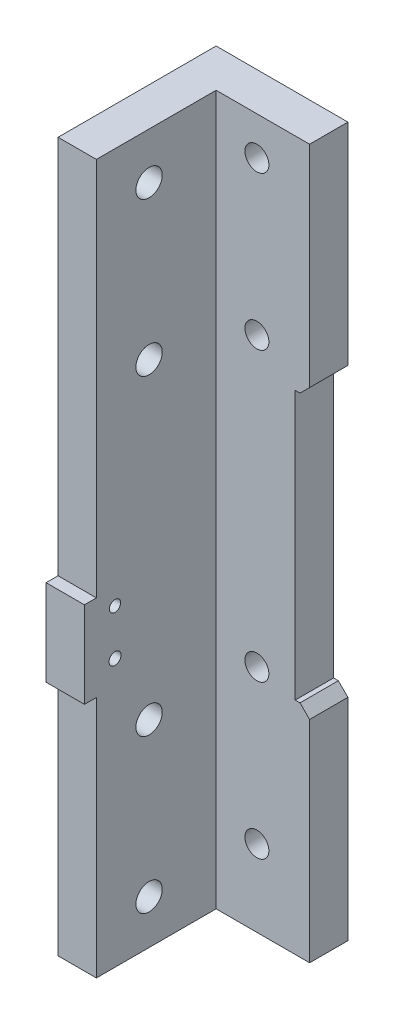
ISO-10303-21;
HEADER;
FILE_DESCRIPTION(('STEP AP214'),'2;1');
FILE_NAME('part.step','',(''),(''),'','','');
FILE_SCHEMA(('AUTOMOTIVE_DESIGN { 1 0 10303 214 1 1 1 1 }'));
ENDSEC;
DATA;
#1=APPLICATION_CONTEXT('core data for automotive mechanical design processes');
#2=APPLICATION_PROTOCOL_DEFINITION('international standard','automotive_design',2000,#1);
#3=PRODUCT_CONTEXT('',#1,'mechanical');
#4=PRODUCT('Part','Part','',(#3));
#5=PRODUCT_RELATED_PRODUCT_CATEGORY('part','',(#4));
#6=PRODUCT_DEFINITION_FORMATION('','',#4);
#7=PRODUCT_DEFINITION_CONTEXT('part definition',#1,'design');
#8=PRODUCT_DEFINITION('design','',#6,#7);
#9=PRODUCT_DEFINITION_SHAPE('','',#8);
#10=(LENGTH_UNIT() NAMED_UNIT(*) SI_UNIT(.MILLI.,.METRE.));
#11=(NAMED_UNIT(*) PLANE_ANGLE_UNIT() SI_UNIT($,.RADIAN.));
#12=(NAMED_UNIT(*) SI_UNIT($,.STERADIAN.) SOLID_ANGLE_UNIT());
#13=UNCERTAINTY_MEASURE_WITH_UNIT(LENGTH_MEASURE(1.E-05),#10,'distance_accuracy_value','');
#14=(GEOMETRIC_REPRESENTATION_CONTEXT(3) GLOBAL_UNCERTAINTY_ASSIGNED_CONTEXT((#13)) GLOBAL_UNIT_ASSIGNED_CONTEXT((#10,
#11,#12)) REPRESENTATION_CONTEXT('',''));
#15=CARTESIAN_POINT('',(0.,0.,0.));
#16=DIRECTION('',(0.,0.,1.));
#17=DIRECTION('',(1.,0.,0.));
#18=AXIS2_PLACEMENT_3D('',#15,#16,#17);
#19=CARTESIAN_POINT('',(0.,0.,33.));
#20=DIRECTION('',(0.,0.,1.));
#21=DIRECTION('',(1.,0.,0.));
#22=AXIS2_PLACEMENT_3D('',#19,#20,#21);
#23=PLANE('',#22);
#24=DIRECTION('',(-1.,0.,0.));
#25=VECTOR('',#24,1.);
#26=CARTESIAN_POINT('',(0.,68.7222488833628,33.));
#27=LINE('',#26,#25);
#28=CARTESIAN_POINT('',(-16.51,68.7222488833628,33.));
#29=VERTEX_POINT('',#28);
#30=CARTESIAN_POINT('',(-24.51,68.7222488833628,33.));
#31=VERTEX_POINT('',#30);
#32=EDGE_CURVE('E11',#29,#31,#27,.T.);
#33=ORIENTED_EDGE('',*,*,#32,.F.);
#34=DIRECTION('',(0.,1.,0.));
#35=VECTOR('',#34,1.);
#36=CARTESIAN_POINT('',(-16.51,148.,33.));
#37=LINE('',#36,#35);
#38=CARTESIAN_POINT('',(-16.51,148.,33.));
#39=VERTEX_POINT('',#38);
#40=EDGE_CURVE('E419',#29,#39,#37,.T.);
#41=ORIENTED_EDGE('',*,*,#40,.T.);
#42=DIRECTION('',(-1.,0.,0.));
#43=VECTOR('',#42,1.);
#44=CARTESIAN_POINT('',(-24.51,148.,33.));
#45=LINE('',#44,#43);
#46=CARTESIAN_POINT('',(-24.51,148.,33.));
#47=VERTEX_POINT('',#46);
#48=EDGE_CURVE('E385',#39,#47,#45,.T.);
#49=ORIENTED_EDGE('',*,*,#48,.T.);
#50=DIRECTION('',(0.,-1.,0.));
#51=VECTOR('',#50,1.);
#52=CARTESIAN_POINT('',(-24.51,148.,33.));
#53=LINE('',#52,#51);
#54=EDGE_CURVE('E415',#47,#31,#53,.T.);
#55=ORIENTED_EDGE('',*,*,#54,.T.);
#56=EDGE_LOOP('',(#33,#41,#49,#55));
#57=FACE_BOUND('',#56,.T.);
#58=ADVANCED_FACE('F39',(#57),#23,.T.);
#59=CARTESIAN_POINT('',(0.,0.,8.));
#60=DIRECTION('',(-1.,0.,0.));
#61=DIRECTION('',(0.,0.,1.));
#62=AXIS2_PLACEMENT_3D('',#59,#60,#61);
#63=PLANE('',#62);
#64=DIRECTION('',(0.,1.,0.));
#65=VECTOR('',#64,1.);
#66=CARTESIAN_POINT('',(0.,0.,8.));
#67=LINE('',#66,#65);
#68=CARTESIAN_POINT('',(0.,46.,8.));
#69=VERTEX_POINT('',#68);
#70=CARTESIAN_POINT('',(0.,102.,8.));
#71=VERTEX_POINT('',#70);
#72=EDGE_CURVE('E352',#69,#71,#67,.T.);
#73=ORIENTED_EDGE('',*,*,#72,.F.);
#74=DIRECTION('',(0.,0.,-1.));
#75=VECTOR('',#74,1.);
#76=CARTESIAN_POINT('',(0.,46.,54.0977222864644));
#77=LINE('',#76,#75);
#78=CARTESIAN_POINT('',(0.,46.,0.));
#79=VERTEX_POINT('',#78);
#80=EDGE_CURVE('E196',#69,#79,#77,.T.);
#81=ORIENTED_EDGE('',*,*,#80,.T.);
#82=DIRECTION('',(0.,1.,0.));
#83=VECTOR('',#82,1.);
#84=CARTESIAN_POINT('',(0.,0.,0.));
#85=LINE('',#84,#83);
#86=CARTESIAN_POINT('',(0.,102.,0.));
#87=VERTEX_POINT('',#86);
#88=EDGE_CURVE('E351',#79,#87,#85,.T.);
#89=ORIENTED_EDGE('',*,*,#88,.T.);
#90=DIRECTION('',(0.,0.,-1.));
#91=VECTOR('',#90,1.);
#92=CARTESIAN_POINT('',(0.,102.,54.0977222864644));
#93=LINE('',#92,#91);
#94=EDGE_CURVE('E212',#71,#87,#93,.T.);
#95=ORIENTED_EDGE('',*,*,#94,.F.);
#96=EDGE_LOOP('',(#73,#81,#89,#95));
#97=FACE_BOUND('',#96,.T.);
#98=ADVANCED_FACE('F283',(#97),#63,.F.);
#99=CARTESIAN_POINT('',(0.,148.,8.));
#100=DIRECTION('',(0.,-1.,0.));
#101=DIRECTION('',(0.,0.,-1.));
#102=AXIS2_PLACEMENT_3D('',#99,#100,#101);
#103=PLANE('',#102);
#104=DIRECTION('',(-1.,0.,0.));
#105=VECTOR('',#104,1.);
#106=CARTESIAN_POINT('',(0.,148.,0.));
#107=LINE('',#106,#105);
#108=CARTESIAN_POINT('',(3.,148.,0.));
#109=VERTEX_POINT('',#108);
#110=CARTESIAN_POINT('',(-24.51,148.,0.));
#111=VERTEX_POINT('',#110);
#112=EDGE_CURVE('E478',#109,#111,#107,.T.);
#113=ORIENTED_EDGE('',*,*,#112,.T.);
#114=DIRECTION('',(0.,0.,-1.));
#115=VECTOR('',#114,1.);
#116=CARTESIAN_POINT('',(-24.51,148.,8.));
#117=LINE('',#116,#115);
#118=EDGE_CURVE('E373',#47,#111,#117,.T.);
#119=ORIENTED_EDGE('',*,*,#118,.F.);
#120=ORIENTED_EDGE('',*,*,#48,.F.);
#121=DIRECTION('',(0.,0.,-1.));
#122=VECTOR('',#121,1.);
#123=CARTESIAN_POINT('',(-16.51,148.,33.));
#124=LINE('',#123,#122);
#125=CARTESIAN_POINT('',(-16.51,148.,8.));
#126=VERTEX_POINT('',#125);
#127=EDGE_CURVE('E381',#39,#126,#124,.T.);
#128=ORIENTED_EDGE('',*,*,#127,.T.);
#129=DIRECTION('',(-1.,0.,0.));
#130=VECTOR('',#129,1.);
#131=CARTESIAN_POINT('',(0.,148.,8.));
#132=LINE('',#131,#130);
#133=CARTESIAN_POINT('',(3.,148.,8.));
#134=VERTEX_POINT('',#133);
#135=EDGE_CURVE('E354',#134,#126,#132,.T.);
#136=ORIENTED_EDGE('',*,*,#135,.F.);
#137=DIRECTION('',(0.,0.,-1.));
#138=VECTOR('',#137,1.);
#139=CARTESIAN_POINT('',(3.,148.,54.0977222864644));
#140=LINE('',#139,#138);
#141=EDGE_CURVE('E207',#134,#109,#140,.T.);
#142=ORIENTED_EDGE('',*,*,#141,.T.);
#143=EDGE_LOOP('',(#113,#119,#120,#128,#136,#142));
#144=FACE_BOUND('',#143,.T.);
#145=ADVANCED_FACE('F266',(#144),#103,.F.);
#146=CARTESIAN_POINT('',(-24.51,0.,8.));
#147=DIRECTION('',(1.,0.,0.));
#148=DIRECTION('',(0.,0.,-1.));
#149=AXIS2_PLACEMENT_3D('',#146,#147,#148);
#150=PLANE('',#149);
#151=CARTESIAN_POINT('',(-24.51,55.8222488833634,29.1120529863074));
#152=DIRECTION('',(-1.,0.,0.));
#153=DIRECTION('',(0.,0.,1.));
#154=AXIS2_PLACEMENT_3D('',#151,#152,#153);
#155=CIRCLE('',#154,1.25);
#156=CARTESIAN_POINT('',(-24.51,55.8222488833634,30.3620529863074));
#157=VERTEX_POINT('',#156);
#158=EDGE_CURVE('E257',#157,#157,#155,.T.);
#159=ORIENTED_EDGE('',*,*,#158,.F.);
#160=EDGE_LOOP('',(#159));
#161=FACE_BOUND('',#160,.T.);
#162=CARTESIAN_POINT('',(-24.51,65.3222488833634,29.1120529863074));
#163=DIRECTION('',(-1.,0.,0.));
#164=DIRECTION('',(0.,0.,1.));
#165=AXIS2_PLACEMENT_3D('',#162,#163,#164);
#166=CIRCLE('',#165,1.175);
#167=CARTESIAN_POINT('',(-24.51,65.3222488833634,30.2870529863074));
#168=VERTEX_POINT('',#167);
#169=EDGE_CURVE('E251',#168,#168,#166,.T.);
#170=ORIENTED_EDGE('',*,*,#169,.F.);
#171=EDGE_LOOP('',(#170));
#172=FACE_BOUND('',#171,.T.);
#173=DIRECTION('',(0.,0.,-1.));
#174=VECTOR('',#173,1.);
#175=CARTESIAN_POINT('',(-24.51,68.7222488833628,29.5));
#176=LINE('',#175,#174);
#177=CARTESIAN_POINT('',(-24.51,68.7222488833628,35.5));
#178=VERTEX_POINT('',#177);
#179=EDGE_CURVE('E171',#178,#31,#176,.T.);
#180=ORIENTED_EDGE('',*,*,#179,.T.);
#181=ORIENTED_EDGE('',*,*,#54,.F.);
#182=ORIENTED_EDGE('',*,*,#118,.T.);
#183=DIRECTION('',(0.,-1.,0.));
#184=VECTOR('',#183,1.);
#185=CARTESIAN_POINT('',(-24.51,0.,0.));
#186=LINE('',#185,#184);
#187=CARTESIAN_POINT('',(-24.51,0.,0.));
#188=VERTEX_POINT('',#187);
#189=EDGE_CURVE('E359',#111,#188,#186,.T.);
#190=ORIENTED_EDGE('',*,*,#189,.T.);
#191=DIRECTION('',(0.,0.,-1.));
#192=VECTOR('',#191,1.);
#193=CARTESIAN_POINT('',(-24.51,0.,8.));
#194=LINE('',#193,#192);
#195=CARTESIAN_POINT('',(-24.51,0.,33.));
#196=VERTEX_POINT('',#195);
#197=EDGE_CURVE('E376',#196,#188,#194,.T.);
#198=ORIENTED_EDGE('',*,*,#197,.F.);
#199=CARTESIAN_POINT('',(-24.51,50.7222488833628,33.));
#200=VERTEX_POINT('',#199);
#201=EDGE_CURVE('E158',#200,#196,#53,.T.);
#202=ORIENTED_EDGE('',*,*,#201,.F.);
#203=DIRECTION('',(0.,0.,1.));
#204=VECTOR('',#203,1.);
#205=CARTESIAN_POINT('',(-24.51,50.7222488833628,29.5));
#206=LINE('',#205,#204);
#207=CARTESIAN_POINT('',(-24.51,50.7222488833628,35.5));
#208=VERTEX_POINT('',#207);
#209=EDGE_CURVE('E149',#200,#208,#206,.T.);
#210=ORIENTED_EDGE('',*,*,#209,.T.);
#211=DIRECTION('',(0.,1.,0.));
#212=VECTOR('',#211,1.);
#213=CARTESIAN_POINT('',(-24.51,50.7222488833628,35.5));
#214=LINE('',#213,#212);
#215=EDGE_CURVE('E155',#208,#178,#214,.T.);
#216=ORIENTED_EDGE('',*,*,#215,.T.);
#217=EDGE_LOOP('',(#180,#181,#182,#190,#198,#202,#210,#216));
#218=FACE_BOUND('',#217,.T.);
#219=CARTESIAN_POINT('',(-24.51,9.19999999999954,21.9999999999998));
#220=DIRECTION('',(-1.,0.,0.));
#221=DIRECTION('',(0.,0.,1.));
#222=AXIS2_PLACEMENT_3D('',#219,#220,#221);
#223=CIRCLE('',#222,2.75);
#224=CARTESIAN_POINT('',(-24.51,9.19999999999954,24.7499999999998));
#225=VERTEX_POINT('',#224);
#226=EDGE_CURVE('E216',#225,#225,#223,.T.);
#227=ORIENTED_EDGE('',*,*,#226,.F.);
#228=EDGE_LOOP('',(#227));
#229=FACE_BOUND('',#228,.T.);
#230=CARTESIAN_POINT('',(-24.51,41.1999999999995,21.9999999999998));
#231=DIRECTION('',(-1.,0.,0.));
#232=DIRECTION('',(0.,0.,1.));
#233=AXIS2_PLACEMENT_3D('',#230,#231,#232);
#234=CIRCLE('',#233,2.75);
#235=CARTESIAN_POINT('',(-24.51,41.1999999999995,24.7499999999998));
#236=VERTEX_POINT('',#235);
#237=EDGE_CURVE('E706',#236,#236,#234,.T.);
#238=ORIENTED_EDGE('',*,*,#237,.F.);
#239=EDGE_LOOP('',(#238));
#240=FACE_BOUND('',#239,.T.);
#241=CARTESIAN_POINT('',(-24.51,106.3,21.9999999999998));
#242=DIRECTION('',(-1.,0.,0.));
#243=DIRECTION('',(0.,0.,1.));
#244=AXIS2_PLACEMENT_3D('',#241,#242,#243);
#245=CIRCLE('',#244,2.75);
#246=CARTESIAN_POINT('',(-24.51,106.3,24.7499999999998));
#247=VERTEX_POINT('',#246);
#248=EDGE_CURVE('E700',#247,#247,#245,.T.);
#249=ORIENTED_EDGE('',*,*,#248,.F.);
#250=EDGE_LOOP('',(#249));
#251=FACE_BOUND('',#250,.T.);
#252=CARTESIAN_POINT('',(-24.51,138.3,21.9999999999998));
#253=DIRECTION('',(-1.,0.,0.));
#254=DIRECTION('',(0.,0.,1.));
#255=AXIS2_PLACEMENT_3D('',#252,#253,#254);
#256=CIRCLE('',#255,2.75);
#257=CARTESIAN_POINT('',(-24.51,138.3,24.7499999999998));
#258=VERTEX_POINT('',#257);
#259=EDGE_CURVE('E692',#258,#258,#256,.T.);
#260=ORIENTED_EDGE('',*,*,#259,.F.);
#261=EDGE_LOOP('',(#260));
#262=FACE_BOUND('',#261,.T.);
#263=ADVANCED_FACE('F152',(#161,#172,#218,#229,#240,#251,#262),#150,.F.);
#264=CARTESIAN_POINT('',(0.,0.,8.));
#265=DIRECTION('',(0.,1.,0.));
#266=DIRECTION('',(-1.,0.,0.));
#267=AXIS2_PLACEMENT_3D('',#264,#265,#266);
#268=PLANE('',#267);
#269=DIRECTION('',(1.,0.,0.));
#270=VECTOR('',#269,1.);
#271=CARTESIAN_POINT('',(0.,0.,0.));
#272=LINE('',#271,#270);
#273=CARTESIAN_POINT('',(3.,0.,0.));
#274=VERTEX_POINT('',#273);
#275=EDGE_CURVE('E355',#188,#274,#272,.T.);
#276=ORIENTED_EDGE('',*,*,#275,.T.);
#277=DIRECTION('',(0.,0.,-1.));
#278=VECTOR('',#277,1.);
#279=CARTESIAN_POINT('',(3.,0.,54.0977222864644));
#280=LINE('',#279,#278);
#281=CARTESIAN_POINT('',(3.,0.,8.));
#282=VERTEX_POINT('',#281);
#283=EDGE_CURVE('E193',#282,#274,#280,.T.);
#284=ORIENTED_EDGE('',*,*,#283,.F.);
#285=DIRECTION('',(1.,0.,0.));
#286=VECTOR('',#285,1.);
#287=CARTESIAN_POINT('',(0.,0.,8.));
#288=LINE('',#287,#286);
#289=CARTESIAN_POINT('',(-16.51,0.,8.));
#290=VERTEX_POINT('',#289);
#291=EDGE_CURVE('E356',#290,#282,#288,.T.);
#292=ORIENTED_EDGE('',*,*,#291,.F.);
#293=DIRECTION('',(0.,0.,-1.));
#294=VECTOR('',#293,1.);
#295=CARTESIAN_POINT('',(-16.51,0.,33.));
#296=LINE('',#295,#294);
#297=CARTESIAN_POINT('',(-16.51,0.,33.));
#298=VERTEX_POINT('',#297);
#299=EDGE_CURVE('E384',#298,#290,#296,.T.);
#300=ORIENTED_EDGE('',*,*,#299,.F.);
#301=DIRECTION('',(1.,0.,0.));
#302=VECTOR('',#301,1.);
#303=CARTESIAN_POINT('',(-24.51,0.,33.));
#304=LINE('',#303,#302);
#305=EDGE_CURVE('E417',#196,#298,#304,.T.);
#306=ORIENTED_EDGE('',*,*,#305,.F.);
#307=ORIENTED_EDGE('',*,*,#197,.T.);
#308=EDGE_LOOP('',(#276,#284,#292,#300,#306,#307));
#309=FACE_BOUND('',#308,.T.);
#310=ADVANCED_FACE('F265',(#309),#268,.F.);
#311=CARTESIAN_POINT('',(0.,0.,8.));
#312=DIRECTION('',(0.,0.,1.));
#313=DIRECTION('',(1.,0.,0.));
#314=AXIS2_PLACEMENT_3D('',#311,#312,#313);
#315=PLANE('',#314);
#316=CARTESIAN_POINT('',(-8.,140.,8.));
#317=DIRECTION('',(0.,0.,1.));
#318=DIRECTION('',(-1.,0.,0.));
#319=AXIS2_PLACEMENT_3D('',#316,#317,#318);
#320=CIRCLE('',#319,2.5);
#321=CARTESIAN_POINT('',(-10.5,140.,8.));
#322=VERTEX_POINT('',#321);
#323=EDGE_CURVE('E409',#322,#322,#320,.T.);
#324=ORIENTED_EDGE('',*,*,#323,.F.);
#325=EDGE_LOOP('',(#324));
#326=FACE_BOUND('',#325,.T.);
#327=CARTESIAN_POINT('',(-8.,108.,8.));
#328=DIRECTION('',(0.,0.,1.));
#329=DIRECTION('',(-1.,0.,0.));
#330=AXIS2_PLACEMENT_3D('',#327,#328,#329);
#331=CIRCLE('',#330,2.5);
#332=CARTESIAN_POINT('',(-10.5,108.,8.));
#333=VERTEX_POINT('',#332);
#334=EDGE_CURVE('E399',#333,#333,#331,.T.);
#335=ORIENTED_EDGE('',*,*,#334,.F.);
#336=EDGE_LOOP('',(#335));
#337=FACE_BOUND('',#336,.T.);
#338=CARTESIAN_POINT('',(-8.,48.,8.));
#339=DIRECTION('',(0.,0.,1.));
#340=DIRECTION('',(1.,0.,0.));
#341=AXIS2_PLACEMENT_3D('',#338,#339,#340);
#342=CIRCLE('',#341,2.5);
#343=CARTESIAN_POINT('',(-5.5,48.,8.));
#344=VERTEX_POINT('',#343);
#345=EDGE_CURVE('E396',#344,#344,#342,.T.);
#346=ORIENTED_EDGE('',*,*,#345,.F.);
#347=EDGE_LOOP('',(#346));
#348=FACE_BOUND('',#347,.T.);
#349=CARTESIAN_POINT('',(-8.,16.,8.));
#350=DIRECTION('',(0.,0.,1.));
#351=DIRECTION('',(1.,0.,0.));
#352=AXIS2_PLACEMENT_3D('',#349,#350,#351);
#353=CIRCLE('',#352,2.5);
#354=CARTESIAN_POINT('',(-5.5,16.,8.));
#355=VERTEX_POINT('',#354);
#356=EDGE_CURVE('E393',#355,#355,#353,.T.);
#357=ORIENTED_EDGE('',*,*,#356,.F.);
#358=EDGE_LOOP('',(#357));
#359=FACE_BOUND('',#358,.T.);
#360=DIRECTION('',(0.,-1.,0.));
#361=VECTOR('',#360,1.);
#362=CARTESIAN_POINT('',(3.,0.,8.));
#363=LINE('',#362,#361);
#364=CARTESIAN_POINT('',(3.,44.,8.));
#365=VERTEX_POINT('',#364);
#366=EDGE_CURVE('E191',#365,#282,#363,.T.);
#367=ORIENTED_EDGE('',*,*,#366,.F.);
#368=DIRECTION('',(0.707106781186545,-0.70710678118655,0.));
#369=VECTOR('',#368,1.);
#370=CARTESIAN_POINT('',(23.5,23.4999999999998,8.));
#371=LINE('',#370,#369);
#372=CARTESIAN_POINT('',(0.999999999999994,46.,8.));
#373=VERTEX_POINT('',#372);
#374=EDGE_CURVE('E237',#365,#373,#371,.F.);
#375=ORIENTED_EDGE('',*,*,#374,.T.);
#376=DIRECTION('',(1.,0.,0.));
#377=VECTOR('',#376,1.);
#378=CARTESIAN_POINT('',(0.,46.,8.));
#379=LINE('',#378,#377);
#380=EDGE_CURVE('E186',#69,#373,#379,.T.);
#381=ORIENTED_EDGE('',*,*,#380,.F.);
#382=ORIENTED_EDGE('',*,*,#72,.T.);
#383=DIRECTION('',(-1.,0.,0.));
#384=VECTOR('',#383,1.);
#385=CARTESIAN_POINT('',(0.,102.,8.));
#386=LINE('',#385,#384);
#387=CARTESIAN_POINT('',(0.999999999999998,102.,8.));
#388=VERTEX_POINT('',#387);
#389=EDGE_CURVE('E206',#388,#71,#386,.T.);
#390=ORIENTED_EDGE('',*,*,#389,.F.);
#391=DIRECTION('',(-0.70710678118655,-0.707106781186545,0.));
#392=VECTOR('',#391,1.);
#393=CARTESIAN_POINT('',(-50.5,50.5000000000003,8.));
#394=LINE('',#393,#392);
#395=CARTESIAN_POINT('',(3.00000000000001,104.,8.));
#396=VERTEX_POINT('',#395);
#397=EDGE_CURVE('E234',#388,#396,#394,.F.);
#398=ORIENTED_EDGE('',*,*,#397,.T.);
#399=DIRECTION('',(0.,-1.,0.));
#400=VECTOR('',#399,1.);
#401=CARTESIAN_POINT('',(3.,148.,8.));
#402=LINE('',#401,#400);
#403=EDGE_CURVE('E203',#134,#396,#402,.T.);
#404=ORIENTED_EDGE('',*,*,#403,.F.);
#405=ORIENTED_EDGE('',*,*,#135,.T.);
#406=DIRECTION('',(0.,1.,0.));
#407=VECTOR('',#406,1.);
#408=CARTESIAN_POINT('',(-16.51,148.,8.));
#409=LINE('',#408,#407);
#410=EDGE_CURVE('E377',#290,#126,#409,.T.);
#411=ORIENTED_EDGE('',*,*,#410,.F.);
#412=ORIENTED_EDGE('',*,*,#291,.T.);
#413=EDGE_LOOP('',(#367,#375,#381,#382,#390,#398,#404,#405,#411,#412));
#414=FACE_BOUND('',#413,.T.);
#415=ADVANCED_FACE('F310',(#326,#337,#348,#359,#414),#315,.T.);
#416=CARTESIAN_POINT('',(0.,0.,0.));
#417=DIRECTION('',(0.,0.,1.));
#418=DIRECTION('',(1.,0.,0.));
#419=AXIS2_PLACEMENT_3D('',#416,#417,#418);
#420=PLANE('',#419);
#421=CARTESIAN_POINT('',(-8.,140.,0.));
#422=DIRECTION('',(0.,0.,1.));
#423=DIRECTION('',(1.,0.,0.));
#424=AXIS2_PLACEMENT_3D('',#421,#422,#423);
#425=CIRCLE('',#424,2.5);
#426=CARTESIAN_POINT('',(-5.5,140.,0.));
#427=VERTEX_POINT('',#426);
#428=EDGE_CURVE('E217',#427,#427,#425,.T.);
#429=ORIENTED_EDGE('',*,*,#428,.T.);
#430=EDGE_LOOP('',(#429));
#431=FACE_BOUND('',#430,.T.);
#432=CARTESIAN_POINT('',(-8.,108.,0.));
#433=DIRECTION('',(0.,0.,1.));
#434=DIRECTION('',(1.,0.,0.));
#435=AXIS2_PLACEMENT_3D('',#432,#433,#434);
#436=CIRCLE('',#435,2.5);
#437=CARTESIAN_POINT('',(-5.5,108.,0.));
#438=VERTEX_POINT('',#437);
#439=EDGE_CURVE('E397',#438,#438,#436,.T.);
#440=ORIENTED_EDGE('',*,*,#439,.T.);
#441=EDGE_LOOP('',(#440));
#442=FACE_BOUND('',#441,.T.);
#443=CARTESIAN_POINT('',(-8.,48.,0.));
#444=DIRECTION('',(0.,0.,1.));
#445=DIRECTION('',(1.,0.,0.));
#446=AXIS2_PLACEMENT_3D('',#443,#444,#445);
#447=CIRCLE('',#446,2.5);
#448=CARTESIAN_POINT('',(-5.5,48.,0.));
#449=VERTEX_POINT('',#448);
#450=EDGE_CURVE('E394',#449,#449,#447,.T.);
#451=ORIENTED_EDGE('',*,*,#450,.T.);
#452=EDGE_LOOP('',(#451));
#453=FACE_BOUND('',#452,.T.);
#454=CARTESIAN_POINT('',(-8.,16.,0.));
#455=DIRECTION('',(0.,0.,1.));
#456=DIRECTION('',(1.,0.,0.));
#457=AXIS2_PLACEMENT_3D('',#454,#455,#456);
#458=CIRCLE('',#457,2.5);
#459=CARTESIAN_POINT('',(-5.5,16.,0.));
#460=VERTEX_POINT('',#459);
#461=EDGE_CURVE('E380',#460,#460,#458,.T.);
#462=ORIENTED_EDGE('',*,*,#461,.T.);
#463=EDGE_LOOP('',(#462));
#464=FACE_BOUND('',#463,.T.);
#465=DIRECTION('',(1.,0.,0.));
#466=VECTOR('',#465,1.);
#467=CARTESIAN_POINT('',(0.,46.,0.));
#468=LINE('',#467,#466);
#469=CARTESIAN_POINT('',(0.999999999999998,46.,0.));
#470=VERTEX_POINT('',#469);
#471=EDGE_CURVE('E182',#79,#470,#468,.T.);
#472=ORIENTED_EDGE('',*,*,#471,.T.);
#473=DIRECTION('',(-0.707106781186545,0.70710678118655,0.));
#474=VECTOR('',#473,1.);
#475=CARTESIAN_POINT('',(0.999999999999998,46.,0.));
#476=LINE('',#475,#474);
#477=CARTESIAN_POINT('',(3.,44.,0.));
#478=VERTEX_POINT('',#477);
#479=EDGE_CURVE('E230',#470,#478,#476,.F.);
#480=ORIENTED_EDGE('',*,*,#479,.T.);
#481=DIRECTION('',(0.,-1.,0.));
#482=VECTOR('',#481,1.);
#483=CARTESIAN_POINT('',(3.,0.,0.));
#484=LINE('',#483,#482);
#485=EDGE_CURVE('E184',#478,#274,#484,.T.);
#486=ORIENTED_EDGE('',*,*,#485,.T.);
#487=ORIENTED_EDGE('',*,*,#275,.F.);
#488=ORIENTED_EDGE('',*,*,#189,.F.);
#489=ORIENTED_EDGE('',*,*,#112,.F.);
#490=DIRECTION('',(0.,-1.,0.));
#491=VECTOR('',#490,1.);
#492=CARTESIAN_POINT('',(3.,148.,0.));
#493=LINE('',#492,#491);
#494=CARTESIAN_POINT('',(3.,104.,0.));
#495=VERTEX_POINT('',#494);
#496=EDGE_CURVE('E199',#109,#495,#493,.T.);
#497=ORIENTED_EDGE('',*,*,#496,.T.);
#498=DIRECTION('',(0.70710678118655,0.707106781186545,0.));
#499=VECTOR('',#498,1.);
#500=CARTESIAN_POINT('',(2.99999999999999,104.,0.));
#501=LINE('',#500,#499);
#502=CARTESIAN_POINT('',(0.999999999999979,102.,0.));
#503=VERTEX_POINT('',#502);
#504=EDGE_CURVE('E228',#495,#503,#501,.F.);
#505=ORIENTED_EDGE('',*,*,#504,.T.);
#506=DIRECTION('',(-1.,0.,0.));
#507=VECTOR('',#506,1.);
#508=CARTESIAN_POINT('',(0.,102.,0.));
#509=LINE('',#508,#507);
#510=EDGE_CURVE('E202',#503,#87,#509,.T.);
#511=ORIENTED_EDGE('',*,*,#510,.T.);
#512=ORIENTED_EDGE('',*,*,#88,.F.);
#513=EDGE_LOOP('',(#472,#480,#486,#487,#488,#489,#497,#505,#511,#512));
#514=FACE_BOUND('',#513,.T.);
#515=ADVANCED_FACE('F305',(#431,#442,#453,#464,#514),#420,.F.);
#516=CARTESIAN_POINT('',(-16.51,148.,33.));
#517=DIRECTION('',(-1.,0.,0.));
#518=DIRECTION('',(0.,-1.,0.));
#519=AXIS2_PLACEMENT_3D('',#516,#517,#518);
#520=PLANE('',#519);
#521=CARTESIAN_POINT('',(-16.51,55.8222488833634,29.1120529863074));
#522=DIRECTION('',(-1.,0.,0.));
#523=DIRECTION('',(0.,-1.,0.));
#524=AXIS2_PLACEMENT_3D('',#521,#522,#523);
#525=CIRCLE('',#524,1.25);
#526=CARTESIAN_POINT('',(-16.51,54.5722488833634,29.1120529863074));
#527=VERTEX_POINT('',#526);
#528=EDGE_CURVE('E254',#527,#527,#525,.F.);
#529=ORIENTED_EDGE('',*,*,#528,.F.);
#530=EDGE_LOOP('',(#529));
#531=FACE_BOUND('',#530,.T.);
#532=CARTESIAN_POINT('',(-16.51,65.3222488833634,29.1120529863074));
#533=DIRECTION('',(-1.,0.,0.));
#534=DIRECTION('',(0.,-1.,0.));
#535=AXIS2_PLACEMENT_3D('',#532,#533,#534);
#536=CIRCLE('',#535,1.175);
#537=CARTESIAN_POINT('',(-16.51,64.1472488833634,29.1120529863074));
#538=VERTEX_POINT('',#537);
#539=EDGE_CURVE('E160',#538,#538,#536,.F.);
#540=ORIENTED_EDGE('',*,*,#539,.F.);
#541=EDGE_LOOP('',(#540));
#542=FACE_BOUND('',#541,.T.);
#543=CARTESIAN_POINT('',(-16.51,9.19999999999954,21.9999999999998));
#544=DIRECTION('',(-1.,0.,0.));
#545=DIRECTION('',(0.,-1.,0.));
#546=AXIS2_PLACEMENT_3D('',#543,#544,#545);
#547=CIRCLE('',#546,2.75);
#548=CARTESIAN_POINT('',(-16.51,6.44999999999954,21.9999999999998));
#549=VERTEX_POINT('',#548);
#550=EDGE_CURVE('E709',#549,#549,#547,.F.);
#551=ORIENTED_EDGE('',*,*,#550,.F.);
#552=EDGE_LOOP('',(#551));
#553=FACE_BOUND('',#552,.T.);
#554=CARTESIAN_POINT('',(-16.51,41.1999999999995,21.9999999999998));
#555=DIRECTION('',(-1.,0.,0.));
#556=DIRECTION('',(0.,-1.,0.));
#557=AXIS2_PLACEMENT_3D('',#554,#555,#556);
#558=CIRCLE('',#557,2.75);
#559=CARTESIAN_POINT('',(-16.51,38.4499999999995,21.9999999999998));
#560=VERTEX_POINT('',#559);
#561=EDGE_CURVE('E703',#560,#560,#558,.F.);
#562=ORIENTED_EDGE('',*,*,#561,.F.);
#563=EDGE_LOOP('',(#562));
#564=FACE_BOUND('',#563,.T.);
#565=CARTESIAN_POINT('',(-16.51,106.3,21.9999999999998));
#566=DIRECTION('',(-1.,0.,0.));
#567=DIRECTION('',(0.,-1.,0.));
#568=AXIS2_PLACEMENT_3D('',#565,#566,#567);
#569=CIRCLE('',#568,2.75);
#570=CARTESIAN_POINT('',(-16.51,103.55,21.9999999999998));
#571=VERTEX_POINT('',#570);
#572=EDGE_CURVE('E695',#571,#571,#569,.F.);
#573=ORIENTED_EDGE('',*,*,#572,.F.);
#574=EDGE_LOOP('',(#573));
#575=FACE_BOUND('',#574,.T.);
#576=CARTESIAN_POINT('',(-16.51,138.3,21.9999999999998));
#577=DIRECTION('',(-1.,0.,0.));
#578=DIRECTION('',(0.,-1.,0.));
#579=AXIS2_PLACEMENT_3D('',#576,#577,#578);
#580=CIRCLE('',#579,2.75);
#581=CARTESIAN_POINT('',(-16.51,135.55,21.9999999999998));
#582=VERTEX_POINT('',#581);
#583=EDGE_CURVE('E690',#582,#582,#580,.F.);
#584=ORIENTED_EDGE('',*,*,#583,.F.);
#585=EDGE_LOOP('',(#584));
#586=FACE_BOUND('',#585,.T.);
#587=ORIENTED_EDGE('',*,*,#40,.F.);
#588=DIRECTION('',(0.,0.,1.));
#589=VECTOR('',#588,1.);
#590=CARTESIAN_POINT('',(-16.51,68.7222488833628,29.5));
#591=LINE('',#590,#589);
#592=CARTESIAN_POINT('',(-16.51,68.7222488833628,35.5));
#593=VERTEX_POINT('',#592);
#594=EDGE_CURVE('E183',#29,#593,#591,.T.);
#595=ORIENTED_EDGE('',*,*,#594,.T.);
#596=DIRECTION('',(0.,-1.,0.));
#597=VECTOR('',#596,1.);
#598=CARTESIAN_POINT('',(-16.51,50.7222488833628,35.5));
#599=LINE('',#598,#597);
#600=CARTESIAN_POINT('',(-16.51,50.7222488833628,35.5));
#601=VERTEX_POINT('',#600);
#602=EDGE_CURVE('E179',#593,#601,#599,.T.);
#603=ORIENTED_EDGE('',*,*,#602,.T.);
#604=DIRECTION('',(0.,0.,-1.));
#605=VECTOR('',#604,1.);
#606=CARTESIAN_POINT('',(-16.51,50.7222488833628,29.5));
#607=LINE('',#606,#605);
#608=CARTESIAN_POINT('',(-16.51,50.7222488833628,33.));
#609=VERTEX_POINT('',#608);
#610=EDGE_CURVE('E167',#601,#609,#607,.T.);
#611=ORIENTED_EDGE('',*,*,#610,.T.);
#612=EDGE_CURVE('E54',#298,#609,#37,.T.);
#613=ORIENTED_EDGE('',*,*,#612,.F.);
#614=ORIENTED_EDGE('',*,*,#299,.T.);
#615=ORIENTED_EDGE('',*,*,#410,.T.);
#616=ORIENTED_EDGE('',*,*,#127,.F.);
#617=EDGE_LOOP('',(#587,#595,#603,#611,#613,#614,#615,#616));
#618=FACE_BOUND('',#617,.T.);
#619=ADVANCED_FACE('F244',(#531,#542,#553,#564,#575,#586,#618),#520,.F.);
#620=DIRECTION('',(1.,0.,0.));
#621=VECTOR('',#620,1.);
#622=CARTESIAN_POINT('',(0.,50.7222488833628,33.));
#623=LINE('',#622,#621);
#624=EDGE_CURVE('E47',#200,#609,#623,.T.);
#625=ORIENTED_EDGE('',*,*,#624,.F.);
#626=ORIENTED_EDGE('',*,*,#201,.T.);
#627=ORIENTED_EDGE('',*,*,#305,.T.);
#628=ORIENTED_EDGE('',*,*,#612,.T.);
#629=EDGE_LOOP('',(#625,#626,#627,#628));
#630=FACE_BOUND('',#629,.T.);
#631=ADVANCED_FACE('F286',(#630),#23,.T.);
#632=CARTESIAN_POINT('',(-8.,16.,-2.));
#633=DIRECTION('',(0.,0.,1.));
#634=DIRECTION('',(1.,0.,0.));
#635=AXIS2_PLACEMENT_3D('',#632,#633,#634);
#636=CYLINDRICAL_SURFACE('',#635,2.5);
#637=ORIENTED_EDGE('',*,*,#356,.T.);
#638=EDGE_LOOP('',(#637));
#639=FACE_BOUND('',#638,.T.);
#640=ORIENTED_EDGE('',*,*,#461,.F.);
#641=EDGE_LOOP('',(#640));
#642=FACE_BOUND('',#641,.T.);
#643=ADVANCED_FACE('F297',(#639,#642),#636,.F.);
#644=CARTESIAN_POINT('',(-8.,48.,-2.));
#645=DIRECTION('',(0.,0.,1.));
#646=DIRECTION('',(1.,0.,0.));
#647=AXIS2_PLACEMENT_3D('',#644,#645,#646);
#648=CYLINDRICAL_SURFACE('',#647,2.5);
#649=ORIENTED_EDGE('',*,*,#345,.T.);
#650=EDGE_LOOP('',(#649));
#651=FACE_BOUND('',#650,.T.);
#652=ORIENTED_EDGE('',*,*,#450,.F.);
#653=EDGE_LOOP('',(#652));
#654=FACE_BOUND('',#653,.T.);
#655=ADVANCED_FACE('F302',(#651,#654),#648,.F.);
#656=CARTESIAN_POINT('',(-8.,108.,-2.));
#657=DIRECTION('',(0.,0.,1.));
#658=DIRECTION('',(1.,0.,0.));
#659=AXIS2_PLACEMENT_3D('',#656,#657,#658);
#660=CYLINDRICAL_SURFACE('',#659,2.5);
#661=ORIENTED_EDGE('',*,*,#334,.T.);
#662=EDGE_LOOP('',(#661));
#663=FACE_BOUND('',#662,.T.);
#664=ORIENTED_EDGE('',*,*,#439,.F.);
#665=EDGE_LOOP('',(#664));
#666=FACE_BOUND('',#665,.T.);
#667=ADVANCED_FACE('F461',(#663,#666),#660,.F.);
#668=CARTESIAN_POINT('',(-8.,140.,-2.));
#669=DIRECTION('',(0.,0.,1.));
#670=DIRECTION('',(1.,0.,0.));
#671=AXIS2_PLACEMENT_3D('',#668,#669,#670);
#672=CYLINDRICAL_SURFACE('',#671,2.5);
#673=ORIENTED_EDGE('',*,*,#323,.T.);
#674=EDGE_LOOP('',(#673));
#675=FACE_BOUND('',#674,.T.);
#676=ORIENTED_EDGE('',*,*,#428,.F.);
#677=EDGE_LOOP('',(#676));
#678=FACE_BOUND('',#677,.T.);
#679=ADVANCED_FACE('F457',(#675,#678),#672,.F.);
#680=CARTESIAN_POINT('',(-8.73182540694797,138.3,21.9999999999998));
#681=DIRECTION('',(-1.,0.,0.));
#682=DIRECTION('',(0.,0.,1.));
#683=AXIS2_PLACEMENT_3D('',#680,#681,#682);
#684=CYLINDRICAL_SURFACE('',#683,2.75);
#685=ORIENTED_EDGE('',*,*,#583,.T.);
#686=EDGE_LOOP('',(#685));
#687=FACE_BOUND('',#686,.T.);
#688=ORIENTED_EDGE('',*,*,#259,.T.);
#689=EDGE_LOOP('',(#688));
#690=FACE_BOUND('',#689,.T.);
#691=ADVANCED_FACE('F453',(#687,#690),#684,.F.);
#692=CARTESIAN_POINT('',(-8.73182540694797,106.3,21.9999999999998));
#693=DIRECTION('',(-1.,0.,0.));
#694=DIRECTION('',(0.,0.,1.));
#695=AXIS2_PLACEMENT_3D('',#692,#693,#694);
#696=CYLINDRICAL_SURFACE('',#695,2.75);
#697=ORIENTED_EDGE('',*,*,#572,.T.);
#698=EDGE_LOOP('',(#697));
#699=FACE_BOUND('',#698,.T.);
#700=ORIENTED_EDGE('',*,*,#248,.T.);
#701=EDGE_LOOP('',(#700));
#702=FACE_BOUND('',#701,.T.);
#703=ADVANCED_FACE('F449',(#699,#702),#696,.F.);
#704=CARTESIAN_POINT('',(-8.73182540694797,41.1999999999995,21.9999999999998));
#705=DIRECTION('',(-1.,0.,0.));
#706=DIRECTION('',(0.,0.,1.));
#707=AXIS2_PLACEMENT_3D('',#704,#705,#706);
#708=CYLINDRICAL_SURFACE('',#707,2.75);
#709=ORIENTED_EDGE('',*,*,#561,.T.);
#710=EDGE_LOOP('',(#709));
#711=FACE_BOUND('',#710,.T.);
#712=ORIENTED_EDGE('',*,*,#237,.T.);
#713=EDGE_LOOP('',(#712));
#714=FACE_BOUND('',#713,.T.);
#715=ADVANCED_FACE('F445',(#711,#714),#708,.F.);
#716=CARTESIAN_POINT('',(-8.73182540694797,9.19999999999954,21.9999999999998));
#717=DIRECTION('',(-1.,0.,0.));
#718=DIRECTION('',(0.,0.,1.));
#719=AXIS2_PLACEMENT_3D('',#716,#717,#718);
#720=CYLINDRICAL_SURFACE('',#719,2.75);
#721=ORIENTED_EDGE('',*,*,#550,.T.);
#722=EDGE_LOOP('',(#721));
#723=FACE_BOUND('',#722,.T.);
#724=ORIENTED_EDGE('',*,*,#226,.T.);
#725=EDGE_LOOP('',(#724));
#726=FACE_BOUND('',#725,.T.);
#727=ADVANCED_FACE('F441',(#723,#726),#720,.F.);
#728=CARTESIAN_POINT('',(3.,148.,54.0977222864644));
#729=DIRECTION('',(1.,0.,0.));
#730=DIRECTION('',(0.,1.,0.));
#731=AXIS2_PLACEMENT_3D('',#728,#729,#730);
#732=PLANE('',#731);
#733=ORIENTED_EDGE('',*,*,#403,.T.);
#734=DIRECTION('',(0.,0.,-1.));
#735=VECTOR('',#734,1.);
#736=CARTESIAN_POINT('',(2.99999999999999,104.,54.0977222864644));
#737=LINE('',#736,#735);
#738=EDGE_CURVE('E239',#396,#495,#737,.T.);
#739=ORIENTED_EDGE('',*,*,#738,.T.);
#740=ORIENTED_EDGE('',*,*,#496,.F.);
#741=ORIENTED_EDGE('',*,*,#141,.F.);
#742=EDGE_LOOP('',(#733,#739,#740,#741));
#743=FACE_BOUND('',#742,.T.);
#744=ADVANCED_FACE('F437',(#743),#732,.T.);
#745=CARTESIAN_POINT('',(0.,102.,54.0977222864644));
#746=DIRECTION('',(0.,-1.,0.));
#747=DIRECTION('',(0.,0.,-1.));
#748=AXIS2_PLACEMENT_3D('',#745,#746,#747);
#749=PLANE('',#748);
#750=ORIENTED_EDGE('',*,*,#510,.F.);
#751=DIRECTION('',(0.,0.,1.));
#752=VECTOR('',#751,1.);
#753=CARTESIAN_POINT('',(0.999999999999979,102.,54.0977222864644));
#754=LINE('',#753,#752);
#755=EDGE_CURVE('E242',#503,#388,#754,.T.);
#756=ORIENTED_EDGE('',*,*,#755,.T.);
#757=ORIENTED_EDGE('',*,*,#389,.T.);
#758=ORIENTED_EDGE('',*,*,#94,.T.);
#759=EDGE_LOOP('',(#750,#756,#757,#758));
#760=FACE_BOUND('',#759,.T.);
#761=ADVANCED_FACE('F434',(#760),#749,.T.);
#762=CARTESIAN_POINT('',(0.,46.,54.0977222864644));
#763=DIRECTION('',(0.,1.,0.));
#764=DIRECTION('',(0.,0.,1.));
#765=AXIS2_PLACEMENT_3D('',#762,#763,#764);
#766=PLANE('',#765);
#767=ORIENTED_EDGE('',*,*,#380,.T.);
#768=DIRECTION('',(0.,0.,-1.));
#769=VECTOR('',#768,1.);
#770=CARTESIAN_POINT('',(0.999999999999998,46.,54.0977222864644));
#771=LINE('',#770,#769);
#772=EDGE_CURVE('E226',#373,#470,#771,.T.);
#773=ORIENTED_EDGE('',*,*,#772,.T.);
#774=ORIENTED_EDGE('',*,*,#471,.F.);
#775=ORIENTED_EDGE('',*,*,#80,.F.);
#776=EDGE_LOOP('',(#767,#773,#774,#775));
#777=FACE_BOUND('',#776,.T.);
#778=ADVANCED_FACE('F334',(#777),#766,.T.);
#779=CARTESIAN_POINT('',(3.,0.,54.0977222864644));
#780=DIRECTION('',(1.,0.,0.));
#781=DIRECTION('',(0.,0.,-1.));
#782=AXIS2_PLACEMENT_3D('',#779,#780,#781);
#783=PLANE('',#782);
#784=ORIENTED_EDGE('',*,*,#485,.F.);
#785=DIRECTION('',(0.,0.,1.));
#786=VECTOR('',#785,1.);
#787=CARTESIAN_POINT('',(3.,44.,54.0977222864644));
#788=LINE('',#787,#786);
#789=EDGE_CURVE('E232',#478,#365,#788,.T.);
#790=ORIENTED_EDGE('',*,*,#789,.T.);
#791=ORIENTED_EDGE('',*,*,#366,.T.);
#792=ORIENTED_EDGE('',*,*,#283,.T.);
#793=EDGE_LOOP('',(#784,#790,#791,#792));
#794=FACE_BOUND('',#793,.T.);
#795=ADVANCED_FACE('F326',(#794),#783,.T.);
#796=CARTESIAN_POINT('',(0.999999999999998,46.,54.0977222864644));
#797=DIRECTION('',(-0.70710678118655,-0.707106781186545,0.));
#798=DIRECTION('',(0.,0.,-1.));
#799=AXIS2_PLACEMENT_3D('',#796,#797,#798);
#800=PLANE('',#799);
#801=ORIENTED_EDGE('',*,*,#374,.F.);
#802=ORIENTED_EDGE('',*,*,#789,.F.);
#803=ORIENTED_EDGE('',*,*,#479,.F.);
#804=ORIENTED_EDGE('',*,*,#772,.F.);
#805=EDGE_LOOP('',(#801,#802,#803,#804));
#806=FACE_BOUND('',#805,.T.);
#807=ADVANCED_FACE('F324',(#806),#800,.F.);
#808=CARTESIAN_POINT('',(2.99999999999999,104.,54.0977222864644));
#809=DIRECTION('',(-0.707106781186545,0.70710678118655,0.));
#810=DIRECTION('',(0.,0.,-1.));
#811=AXIS2_PLACEMENT_3D('',#808,#809,#810);
#812=PLANE('',#811);
#813=ORIENTED_EDGE('',*,*,#397,.F.);
#814=ORIENTED_EDGE('',*,*,#755,.F.);
#815=ORIENTED_EDGE('',*,*,#504,.F.);
#816=ORIENTED_EDGE('',*,*,#738,.F.);
#817=EDGE_LOOP('',(#813,#814,#815,#816));
#818=FACE_BOUND('',#817,.T.);
#819=ADVANCED_FACE('F41',(#818),#812,.F.);
#820=CARTESIAN_POINT('',(2.46366596101028,68.7222488833628,29.5));
#821=DIRECTION('',(0.,1.,0.));
#822=DIRECTION('',(0.,0.,1.));
#823=AXIS2_PLACEMENT_3D('',#820,#821,#822);
#824=PLANE('',#823);
#825=ORIENTED_EDGE('',*,*,#594,.F.);
#826=ORIENTED_EDGE('',*,*,#32,.T.);
#827=ORIENTED_EDGE('',*,*,#179,.F.);
#828=DIRECTION('',(-1.,0.,0.));
#829=VECTOR('',#828,1.);
#830=CARTESIAN_POINT('',(2.46366596101028,68.7222488833628,35.5));
#831=LINE('',#830,#829);
#832=EDGE_CURVE('E170',#593,#178,#831,.T.);
#833=ORIENTED_EDGE('',*,*,#832,.F.);
#834=EDGE_LOOP('',(#825,#826,#827,#833));
#835=FACE_BOUND('',#834,.T.);
#836=ADVANCED_FACE('F332',(#835),#824,.T.);
#837=CARTESIAN_POINT('',(2.46366596101028,50.7222488833628,35.5));
#838=DIRECTION('',(0.,0.,1.));
#839=DIRECTION('',(1.,0.,0.));
#840=AXIS2_PLACEMENT_3D('',#837,#838,#839);
#841=PLANE('',#840);
#842=ORIENTED_EDGE('',*,*,#602,.F.);
#843=ORIENTED_EDGE('',*,*,#832,.T.);
#844=ORIENTED_EDGE('',*,*,#215,.F.);
#845=DIRECTION('',(-1.,0.,0.));
#846=VECTOR('',#845,1.);
#847=CARTESIAN_POINT('',(2.46366596101028,50.7222488833628,35.5));
#848=LINE('',#847,#846);
#849=EDGE_CURVE('E164',#601,#208,#848,.T.);
#850=ORIENTED_EDGE('',*,*,#849,.F.);
#851=EDGE_LOOP('',(#842,#843,#844,#850));
#852=FACE_BOUND('',#851,.T.);
#853=ADVANCED_FACE('F173',(#852),#841,.T.);
#854=CARTESIAN_POINT('',(2.46366596101028,50.7222488833628,29.5));
#855=DIRECTION('',(0.,-1.,0.));
#856=DIRECTION('',(0.,0.,-1.));
#857=AXIS2_PLACEMENT_3D('',#854,#855,#856);
#858=PLANE('',#857);
#859=ORIENTED_EDGE('',*,*,#209,.F.);
#860=ORIENTED_EDGE('',*,*,#624,.T.);
#861=ORIENTED_EDGE('',*,*,#610,.F.);
#862=ORIENTED_EDGE('',*,*,#849,.T.);
#863=EDGE_LOOP('',(#859,#860,#861,#862));
#864=FACE_BOUND('',#863,.T.);
#865=ADVANCED_FACE('F165',(#864),#858,.T.);
#866=CARTESIAN_POINT('',(-12.9744660940673,65.3222488833634,29.1120529863074));
#867=DIRECTION('',(-1.,0.,0.));
#868=DIRECTION('',(0.,0.,1.));
#869=AXIS2_PLACEMENT_3D('',#866,#867,#868);
#870=CYLINDRICAL_SURFACE('',#869,1.175);
#871=ORIENTED_EDGE('',*,*,#539,.T.);
#872=EDGE_LOOP('',(#871));
#873=FACE_BOUND('',#872,.T.);
#874=ORIENTED_EDGE('',*,*,#169,.T.);
#875=EDGE_LOOP('',(#874));
#876=FACE_BOUND('',#875,.T.);
#877=ADVANCED_FACE('F270',(#873,#876),#870,.F.);
#878=CARTESIAN_POINT('',(-12.9744660940673,55.8222488833634,29.1120529863074));
#879=DIRECTION('',(-1.,0.,0.));
#880=DIRECTION('',(0.,0.,1.));
#881=AXIS2_PLACEMENT_3D('',#878,#879,#880);
#882=CYLINDRICAL_SURFACE('',#881,1.25);
#883=ORIENTED_EDGE('',*,*,#528,.T.);
#884=EDGE_LOOP('',(#883));
#885=FACE_BOUND('',#884,.T.);
#886=ORIENTED_EDGE('',*,*,#158,.T.);
#887=EDGE_LOOP('',(#886));
#888=FACE_BOUND('',#887,.T.);
#889=ADVANCED_FACE('F261',(#885,#888),#882,.F.);
#890=CLOSED_SHELL('',(#58,#98,#145,#263,#310,#415,#515,#619,#631,#643,#655,#667,#679,#691,#703,
#715,#727,#744,#761,#778,#795,#807,#819,#836,#853,#865,#877,#889));
#891=MANIFOLD_SOLID_BREP('B2',#890);
#892=ADVANCED_BREP_SHAPE_REPRESENTATION('',(#18,#891),#14);
#893=SHAPE_DEFINITION_REPRESENTATION(#9,#892);
ENDSEC;
END-ISO-10303-21;
